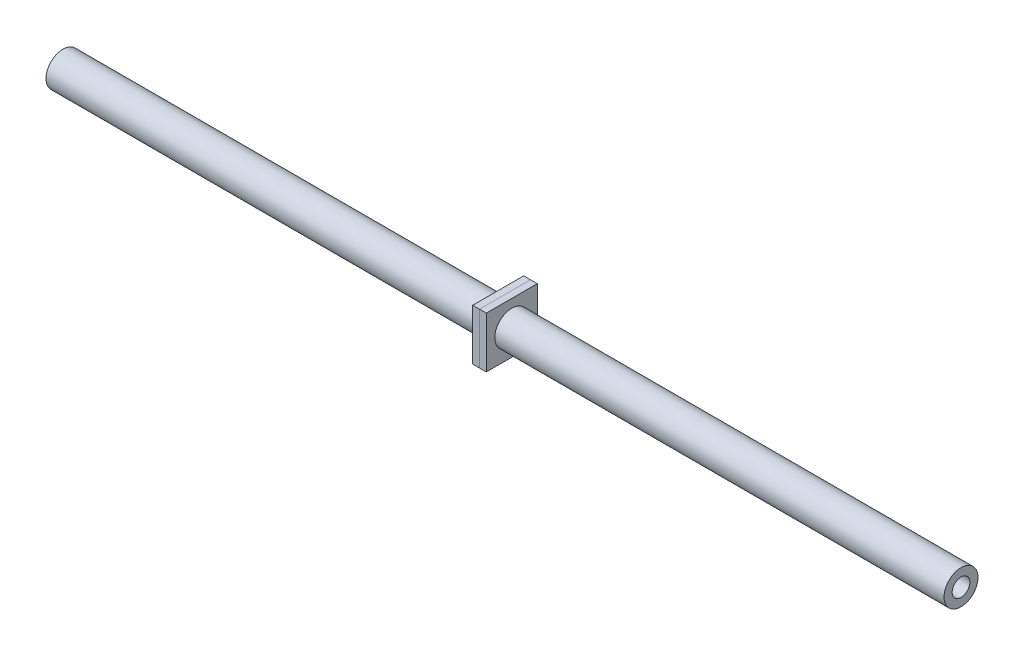
ISO-10303-21;
HEADER;
FILE_DESCRIPTION(('STEP AP214'),'2;1');
FILE_NAME('part.step','',(''),(''),'','','');
FILE_SCHEMA(('AUTOMOTIVE_DESIGN { 1 0 10303 214 1 1 1 1 }'));
ENDSEC;
DATA;
#1=APPLICATION_CONTEXT('core data for automotive mechanical design processes');
#2=APPLICATION_PROTOCOL_DEFINITION('international standard','automotive_design',2000,#1);
#3=PRODUCT_CONTEXT('',#1,'mechanical');
#4=PRODUCT('Part','Part','',(#3));
#5=PRODUCT_RELATED_PRODUCT_CATEGORY('part','',(#4));
#6=PRODUCT_DEFINITION_FORMATION('','',#4);
#7=PRODUCT_DEFINITION_CONTEXT('part definition',#1,'design');
#8=PRODUCT_DEFINITION('design','',#6,#7);
#9=PRODUCT_DEFINITION_SHAPE('','',#8);
#10=(LENGTH_UNIT() NAMED_UNIT(*) SI_UNIT(.MILLI.,.METRE.));
#11=(NAMED_UNIT(*) PLANE_ANGLE_UNIT() SI_UNIT($,.RADIAN.));
#12=(NAMED_UNIT(*) SI_UNIT($,.STERADIAN.) SOLID_ANGLE_UNIT());
#13=UNCERTAINTY_MEASURE_WITH_UNIT(LENGTH_MEASURE(1.E-05),#10,'distance_accuracy_value','');
#14=(GEOMETRIC_REPRESENTATION_CONTEXT(3) GLOBAL_UNCERTAINTY_ASSIGNED_CONTEXT((#13)) GLOBAL_UNIT_ASSIGNED_CONTEXT((#10,
#11,#12)) REPRESENTATION_CONTEXT('',''));
#15=CARTESIAN_POINT('',(0.,0.,0.));
#16=DIRECTION('',(0.,0.,1.));
#17=DIRECTION('',(1.,0.,0.));
#18=AXIS2_PLACEMENT_3D('',#15,#16,#17);
#19=CARTESIAN_POINT('',(162.56,0.,0.));
#20=DIRECTION('',(1.,0.,0.));
#21=DIRECTION('',(0.,0.,-1.));
#22=AXIS2_PLACEMENT_3D('',#19,#20,#21);
#23=PLANE('',#22);
#24=DIRECTION('',(0.,1.,0.));
#25=VECTOR('',#24,1.);
#26=CARTESIAN_POINT('',(162.56,0.,-9.525));
#27=LINE('',#26,#25);
#28=CARTESIAN_POINT('',(162.56,-9.525,-9.525));
#29=VERTEX_POINT('',#28);
#30=CARTESIAN_POINT('',(162.56,9.525,-9.525));
#31=VERTEX_POINT('',#30);
#32=EDGE_CURVE('E113',#29,#31,#27,.T.);
#33=ORIENTED_EDGE('',*,*,#32,.F.);
#34=DIRECTION('',(0.,0.,-1.));
#35=VECTOR('',#34,1.);
#36=CARTESIAN_POINT('',(162.56,-9.525,0.));
#37=LINE('',#36,#35);
#38=CARTESIAN_POINT('',(162.56,-9.52500000000001,9.525));
#39=VERTEX_POINT('',#38);
#40=EDGE_CURVE('E110',#39,#29,#37,.T.);
#41=ORIENTED_EDGE('',*,*,#40,.F.);
#42=DIRECTION('',(0.,-1.,0.));
#43=VECTOR('',#42,1.);
#44=CARTESIAN_POINT('',(162.56,0.,9.525));
#45=LINE('',#44,#43);
#46=CARTESIAN_POINT('',(162.56,9.525,9.52500000000001));
#47=VERTEX_POINT('',#46);
#48=EDGE_CURVE('E103',#47,#39,#45,.T.);
#49=ORIENTED_EDGE('',*,*,#48,.F.);
#50=DIRECTION('',(0.,0.,1.));
#51=VECTOR('',#50,1.);
#52=CARTESIAN_POINT('',(162.56,9.525,0.));
#53=LINE('',#52,#51);
#54=EDGE_CURVE('E109',#31,#47,#53,.T.);
#55=ORIENTED_EDGE('',*,*,#54,.F.);
#56=EDGE_LOOP('',(#33,#41,#49,#55));
#57=FACE_BOUND('',#56,.T.);
#58=CARTESIAN_POINT('',(162.56,0.,0.));
#59=DIRECTION('',(-1.,0.,0.));
#60=DIRECTION('',(0.,0.,1.));
#61=AXIS2_PLACEMENT_3D('',#58,#59,#60);
#62=CIRCLE('',#61,6.35);
#63=CARTESIAN_POINT('',(162.56,0.,6.35));
#64=VERTEX_POINT('',#63);
#65=EDGE_CURVE('E124',#64,#64,#62,.T.);
#66=ORIENTED_EDGE('',*,*,#65,.F.);
#67=EDGE_LOOP('',(#66));
#68=FACE_BOUND('',#67,.T.);
#69=ADVANCED_FACE('F54',(#57,#68),#23,.F.);
#70=CARTESIAN_POINT('',(165.1,0.,0.));
#71=DIRECTION('',(1.,0.,0.));
#72=DIRECTION('',(0.,0.,-1.));
#73=AXIS2_PLACEMENT_3D('',#70,#71,#72);
#74=PLANE('',#73);
#75=DIRECTION('',(0.,1.,0.));
#76=VECTOR('',#75,1.);
#77=CARTESIAN_POINT('',(165.1,0.,-9.525));
#78=LINE('',#77,#76);
#79=CARTESIAN_POINT('',(165.1,-9.525,-9.525));
#80=VERTEX_POINT('',#79);
#81=CARTESIAN_POINT('',(165.1,9.525,-9.525));
#82=VERTEX_POINT('',#81);
#83=EDGE_CURVE('E120',#80,#82,#78,.T.);
#84=ORIENTED_EDGE('',*,*,#83,.T.);
#85=DIRECTION('',(0.,0.,1.));
#86=VECTOR('',#85,1.);
#87=CARTESIAN_POINT('',(165.1,9.525,0.));
#88=LINE('',#87,#86);
#89=CARTESIAN_POINT('',(165.1,9.525,9.52500000000001));
#90=VERTEX_POINT('',#89);
#91=EDGE_CURVE('E123',#82,#90,#88,.T.);
#92=ORIENTED_EDGE('',*,*,#91,.T.);
#93=DIRECTION('',(0.,-1.,0.));
#94=VECTOR('',#93,1.);
#95=CARTESIAN_POINT('',(165.1,0.,9.525));
#96=LINE('',#95,#94);
#97=CARTESIAN_POINT('',(165.1,-9.52500000000001,9.525));
#98=VERTEX_POINT('',#97);
#99=EDGE_CURVE('E105',#90,#98,#96,.T.);
#100=ORIENTED_EDGE('',*,*,#99,.T.);
#101=DIRECTION('',(0.,0.,-1.));
#102=VECTOR('',#101,1.);
#103=CARTESIAN_POINT('',(165.1,-9.525,0.));
#104=LINE('',#103,#102);
#105=EDGE_CURVE('E115',#98,#80,#104,.T.);
#106=ORIENTED_EDGE('',*,*,#105,.T.);
#107=EDGE_LOOP('',(#84,#92,#100,#106));
#108=FACE_BOUND('',#107,.T.);
#109=CARTESIAN_POINT('',(165.1,0.,0.));
#110=DIRECTION('',(-1.,0.,0.));
#111=DIRECTION('',(0.,0.,1.));
#112=AXIS2_PLACEMENT_3D('',#109,#110,#111);
#113=CIRCLE('',#112,6.35);
#114=CARTESIAN_POINT('',(165.1,0.,6.35));
#115=VERTEX_POINT('',#114);
#116=EDGE_CURVE('E158',#115,#115,#113,.T.);
#117=ORIENTED_EDGE('',*,*,#116,.T.);
#118=EDGE_LOOP('',(#117));
#119=FACE_BOUND('',#118,.T.);
#120=ADVANCED_FACE('F130',(#108,#119),#74,.T.);
#121=CARTESIAN_POINT('',(162.56,0.,-9.525));
#122=DIRECTION('',(0.,0.,-1.));
#123=DIRECTION('',(0.,1.,0.));
#124=AXIS2_PLACEMENT_3D('',#121,#122,#123);
#125=PLANE('',#124);
#126=ORIENTED_EDGE('',*,*,#83,.F.);
#127=DIRECTION('',(1.,0.,0.));
#128=VECTOR('',#127,1.);
#129=CARTESIAN_POINT('',(162.56,-9.525,-9.525));
#130=LINE('',#129,#128);
#131=EDGE_CURVE('E13',#29,#80,#130,.T.);
#132=ORIENTED_EDGE('',*,*,#131,.F.);
#133=ORIENTED_EDGE('',*,*,#32,.T.);
#134=DIRECTION('',(1.,0.,0.));
#135=VECTOR('',#134,1.);
#136=CARTESIAN_POINT('',(162.56,9.525,-9.525));
#137=LINE('',#136,#135);
#138=EDGE_CURVE('E58',#31,#82,#137,.T.);
#139=ORIENTED_EDGE('',*,*,#138,.T.);
#140=EDGE_LOOP('',(#126,#132,#133,#139));
#141=FACE_BOUND('',#140,.T.);
#142=ADVANCED_FACE('F56',(#141),#125,.T.);
#143=CARTESIAN_POINT('',(162.56,-9.525,0.));
#144=DIRECTION('',(0.,-1.,0.));
#145=DIRECTION('',(0.,0.,-1.));
#146=AXIS2_PLACEMENT_3D('',#143,#144,#145);
#147=PLANE('',#146);
#148=ORIENTED_EDGE('',*,*,#105,.F.);
#149=DIRECTION('',(1.,0.,0.));
#150=VECTOR('',#149,1.);
#151=CARTESIAN_POINT('',(162.56,-9.52500000000001,9.525));
#152=LINE('',#151,#150);
#153=EDGE_CURVE('E64',#39,#98,#152,.T.);
#154=ORIENTED_EDGE('',*,*,#153,.F.);
#155=ORIENTED_EDGE('',*,*,#40,.T.);
#156=ORIENTED_EDGE('',*,*,#131,.T.);
#157=EDGE_LOOP('',(#148,#154,#155,#156));
#158=FACE_BOUND('',#157,.T.);
#159=ADVANCED_FACE('F132',(#158),#147,.T.);
#160=CARTESIAN_POINT('',(162.56,0.,9.525));
#161=DIRECTION('',(0.,0.,1.));
#162=DIRECTION('',(0.,-1.,0.));
#163=AXIS2_PLACEMENT_3D('',#160,#161,#162);
#164=PLANE('',#163);
#165=ORIENTED_EDGE('',*,*,#99,.F.);
#166=DIRECTION('',(1.,0.,0.));
#167=VECTOR('',#166,1.);
#168=CARTESIAN_POINT('',(162.56,9.525,9.52500000000001));
#169=LINE('',#168,#167);
#170=EDGE_CURVE('E100',#47,#90,#169,.T.);
#171=ORIENTED_EDGE('',*,*,#170,.F.);
#172=ORIENTED_EDGE('',*,*,#48,.T.);
#173=ORIENTED_EDGE('',*,*,#153,.T.);
#174=EDGE_LOOP('',(#165,#171,#172,#173));
#175=FACE_BOUND('',#174,.T.);
#176=ADVANCED_FACE('F102',(#175),#164,.T.);
#177=CARTESIAN_POINT('',(162.56,9.525,0.));
#178=DIRECTION('',(0.,1.,0.));
#179=DIRECTION('',(0.,0.,1.));
#180=AXIS2_PLACEMENT_3D('',#177,#178,#179);
#181=PLANE('',#180);
#182=ORIENTED_EDGE('',*,*,#91,.F.);
#183=ORIENTED_EDGE('',*,*,#138,.F.);
#184=ORIENTED_EDGE('',*,*,#54,.T.);
#185=ORIENTED_EDGE('',*,*,#170,.T.);
#186=EDGE_LOOP('',(#182,#183,#184,#185));
#187=FACE_BOUND('',#186,.T.);
#188=ADVANCED_FACE('F112',(#187),#181,.T.);
#189=CARTESIAN_POINT('',(162.56,0.,0.));
#190=DIRECTION('',(1.,0.,0.));
#191=DIRECTION('',(0.,0.,-1.));
#192=AXIS2_PLACEMENT_3D('',#189,#190,#191);
#193=CYLINDRICAL_SURFACE('',#192,6.35);
#194=ORIENTED_EDGE('',*,*,#65,.T.);
#195=EDGE_LOOP('',(#194));
#196=FACE_BOUND('',#195,.T.);
#197=ORIENTED_EDGE('',*,*,#116,.F.);
#198=EDGE_LOOP('',(#197));
#199=FACE_BOUND('',#198,.T.);
#200=ADVANCED_FACE('F147',(#196,#199),#193,.F.);
#201=CLOSED_SHELL('',(#69,#120,#142,#159,#176,#188,#200));
#202=MANIFOLD_SOLID_BREP('B2',#201);
#203=CARTESIAN_POINT('',(167.64,0.,0.));
#204=DIRECTION('',(-1.,0.,0.));
#205=DIRECTION('',(0.,0.,1.));
#206=AXIS2_PLACEMENT_3D('',#203,#204,#205);
#207=PLANE('',#206);
#208=DIRECTION('',(0.,-1.,0.));
#209=VECTOR('',#208,1.);
#210=CARTESIAN_POINT('',(167.64,9.525,9.52500000000001));
#211=LINE('',#210,#209);
#212=CARTESIAN_POINT('',(167.64,9.525,9.52500000000001));
#213=VERTEX_POINT('',#212);
#214=CARTESIAN_POINT('',(167.64,-9.52500000000001,9.525));
#215=VERTEX_POINT('',#214);
#216=EDGE_CURVE('E257',#213,#215,#211,.T.);
#217=ORIENTED_EDGE('',*,*,#216,.T.);
#218=DIRECTION('',(0.,0.,-1.));
#219=VECTOR('',#218,1.);
#220=CARTESIAN_POINT('',(167.64,-9.525,-9.525));
#221=LINE('',#220,#219);
#222=CARTESIAN_POINT('',(167.64,-9.525,-9.525));
#223=VERTEX_POINT('',#222);
#224=EDGE_CURVE('E252',#215,#223,#221,.T.);
#225=ORIENTED_EDGE('',*,*,#224,.T.);
#226=DIRECTION('',(0.,1.,0.));
#227=VECTOR('',#226,1.);
#228=CARTESIAN_POINT('',(167.64,9.525,-9.525));
#229=LINE('',#228,#227);
#230=CARTESIAN_POINT('',(167.64,9.525,-9.525));
#231=VERTEX_POINT('',#230);
#232=EDGE_CURVE('E255',#223,#231,#229,.T.);
#233=ORIENTED_EDGE('',*,*,#232,.T.);
#234=DIRECTION('',(0.,0.,1.));
#235=VECTOR('',#234,1.);
#236=CARTESIAN_POINT('',(167.64,9.525,-9.525));
#237=LINE('',#236,#235);
#238=EDGE_CURVE('E222',#231,#213,#237,.T.);
#239=ORIENTED_EDGE('',*,*,#238,.T.);
#240=EDGE_LOOP('',(#217,#225,#233,#239));
#241=FACE_BOUND('',#240,.T.);
#242=CARTESIAN_POINT('',(167.64,0.,0.));
#243=DIRECTION('',(1.,0.,0.));
#244=DIRECTION('',(0.,0.,-1.));
#245=AXIS2_PLACEMENT_3D('',#242,#243,#244);
#246=CIRCLE('',#245,6.35);
#247=CARTESIAN_POINT('',(167.64,0.,-6.35));
#248=VERTEX_POINT('',#247);
#249=EDGE_CURVE('E272',#248,#248,#246,.T.);
#250=ORIENTED_EDGE('',*,*,#249,.F.);
#251=EDGE_LOOP('',(#250));
#252=FACE_BOUND('',#251,.T.);
#253=ADVANCED_FACE('F205',(#241,#252),#207,.F.);
#254=CARTESIAN_POINT('',(165.1,0.,0.));
#255=DIRECTION('',(-1.,0.,0.));
#256=DIRECTION('',(0.,0.,1.));
#257=AXIS2_PLACEMENT_3D('',#254,#255,#256);
#258=PLANE('',#257);
#259=DIRECTION('',(0.,-1.,0.));
#260=VECTOR('',#259,1.);
#261=CARTESIAN_POINT('',(165.1,9.525,9.52500000000001));
#262=LINE('',#261,#260);
#263=CARTESIAN_POINT('',(165.1,9.525,9.52500000000001));
#264=VERTEX_POINT('',#263);
#265=CARTESIAN_POINT('',(165.1,-9.52500000000001,9.525));
#266=VERTEX_POINT('',#265);
#267=EDGE_CURVE('E269',#264,#266,#262,.T.);
#268=ORIENTED_EDGE('',*,*,#267,.F.);
#269=DIRECTION('',(0.,0.,1.));
#270=VECTOR('',#269,1.);
#271=CARTESIAN_POINT('',(165.1,9.525,-9.525));
#272=LINE('',#271,#270);
#273=CARTESIAN_POINT('',(165.1,9.525,-9.525));
#274=VERTEX_POINT('',#273);
#275=EDGE_CURVE('E245',#274,#264,#272,.T.);
#276=ORIENTED_EDGE('',*,*,#275,.F.);
#277=DIRECTION('',(0.,1.,0.));
#278=VECTOR('',#277,1.);
#279=CARTESIAN_POINT('',(165.1,9.525,-9.525));
#280=LINE('',#279,#278);
#281=CARTESIAN_POINT('',(165.1,-9.525,-9.525));
#282=VERTEX_POINT('',#281);
#283=EDGE_CURVE('E239',#282,#274,#280,.T.);
#284=ORIENTED_EDGE('',*,*,#283,.F.);
#285=DIRECTION('',(0.,0.,-1.));
#286=VECTOR('',#285,1.);
#287=CARTESIAN_POINT('',(165.1,-9.525,-9.525));
#288=LINE('',#287,#286);
#289=EDGE_CURVE('E261',#266,#282,#288,.T.);
#290=ORIENTED_EDGE('',*,*,#289,.F.);
#291=EDGE_LOOP('',(#268,#276,#284,#290));
#292=FACE_BOUND('',#291,.T.);
#293=CARTESIAN_POINT('',(165.1,0.,0.));
#294=DIRECTION('',(1.,0.,0.));
#295=DIRECTION('',(0.,0.,-1.));
#296=AXIS2_PLACEMENT_3D('',#293,#294,#295);
#297=CIRCLE('',#296,6.35);
#298=CARTESIAN_POINT('',(165.1,0.,-6.35));
#299=VERTEX_POINT('',#298);
#300=EDGE_CURVE('E284',#299,#299,#297,.T.);
#301=ORIENTED_EDGE('',*,*,#300,.T.);
#302=EDGE_LOOP('',(#301));
#303=FACE_BOUND('',#302,.T.);
#304=ADVANCED_FACE('F280',(#292,#303),#258,.T.);
#305=CARTESIAN_POINT('',(167.64,9.525,9.52500000000001));
#306=DIRECTION('',(0.,0.,-1.));
#307=DIRECTION('',(0.,1.,0.));
#308=AXIS2_PLACEMENT_3D('',#305,#306,#307);
#309=PLANE('',#308);
#310=ORIENTED_EDGE('',*,*,#267,.T.);
#311=DIRECTION('',(-1.,0.,0.));
#312=VECTOR('',#311,1.);
#313=CARTESIAN_POINT('',(167.64,-9.52500000000001,9.525));
#314=LINE('',#313,#312);
#315=EDGE_CURVE('E52',#215,#266,#314,.T.);
#316=ORIENTED_EDGE('',*,*,#315,.F.);
#317=ORIENTED_EDGE('',*,*,#216,.F.);
#318=DIRECTION('',(-1.,0.,0.));
#319=VECTOR('',#318,1.);
#320=CARTESIAN_POINT('',(167.64,9.525,9.52500000000001));
#321=LINE('',#320,#319);
#322=EDGE_CURVE('E265',#213,#264,#321,.T.);
#323=ORIENTED_EDGE('',*,*,#322,.T.);
#324=EDGE_LOOP('',(#310,#316,#317,#323));
#325=FACE_BOUND('',#324,.T.);
#326=ADVANCED_FACE('F207',(#325),#309,.F.);
#327=CARTESIAN_POINT('',(167.64,-9.525,-9.525));
#328=DIRECTION('',(0.,1.,0.));
#329=DIRECTION('',(0.,0.,1.));
#330=AXIS2_PLACEMENT_3D('',#327,#328,#329);
#331=PLANE('',#330);
#332=ORIENTED_EDGE('',*,*,#289,.T.);
#333=DIRECTION('',(-1.,0.,0.));
#334=VECTOR('',#333,1.);
#335=CARTESIAN_POINT('',(167.64,-9.525,-9.525));
#336=LINE('',#335,#334);
#337=EDGE_CURVE('E214',#223,#282,#336,.T.);
#338=ORIENTED_EDGE('',*,*,#337,.F.);
#339=ORIENTED_EDGE('',*,*,#224,.F.);
#340=ORIENTED_EDGE('',*,*,#315,.T.);
#341=EDGE_LOOP('',(#332,#338,#339,#340));
#342=FACE_BOUND('',#341,.T.);
#343=ADVANCED_FACE('F260',(#342),#331,.F.);
#344=CARTESIAN_POINT('',(167.64,9.525,-9.525));
#345=DIRECTION('',(0.,0.,1.));
#346=DIRECTION('',(0.,-1.,0.));
#347=AXIS2_PLACEMENT_3D('',#344,#345,#346);
#348=PLANE('',#347);
#349=ORIENTED_EDGE('',*,*,#283,.T.);
#350=DIRECTION('',(-1.,0.,0.));
#351=VECTOR('',#350,1.);
#352=CARTESIAN_POINT('',(167.64,9.525,-9.525));
#353=LINE('',#352,#351);
#354=EDGE_CURVE('E262',#231,#274,#353,.T.);
#355=ORIENTED_EDGE('',*,*,#354,.F.);
#356=ORIENTED_EDGE('',*,*,#232,.F.);
#357=ORIENTED_EDGE('',*,*,#337,.T.);
#358=EDGE_LOOP('',(#349,#355,#356,#357));
#359=FACE_BOUND('',#358,.T.);
#360=ADVANCED_FACE('F263',(#359),#348,.F.);
#361=CARTESIAN_POINT('',(167.64,9.525,-9.525));
#362=DIRECTION('',(0.,-1.,0.));
#363=DIRECTION('',(0.,0.,-1.));
#364=AXIS2_PLACEMENT_3D('',#361,#362,#363);
#365=PLANE('',#364);
#366=ORIENTED_EDGE('',*,*,#275,.T.);
#367=ORIENTED_EDGE('',*,*,#322,.F.);
#368=ORIENTED_EDGE('',*,*,#238,.F.);
#369=ORIENTED_EDGE('',*,*,#354,.T.);
#370=EDGE_LOOP('',(#366,#367,#368,#369));
#371=FACE_BOUND('',#370,.T.);
#372=ADVANCED_FACE('F277',(#371),#365,.F.);
#373=CARTESIAN_POINT('',(167.64,0.,0.));
#374=DIRECTION('',(-1.,0.,0.));
#375=DIRECTION('',(0.,0.,1.));
#376=AXIS2_PLACEMENT_3D('',#373,#374,#375);
#377=CYLINDRICAL_SURFACE('',#376,6.35);
#378=ORIENTED_EDGE('',*,*,#249,.T.);
#379=EDGE_LOOP('',(#378));
#380=FACE_BOUND('',#379,.T.);
#381=ORIENTED_EDGE('',*,*,#300,.F.);
#382=EDGE_LOOP('',(#381));
#383=FACE_BOUND('',#382,.T.);
#384=ADVANCED_FACE('F290',(#380,#383),#377,.F.);
#385=CLOSED_SHELL('',(#253,#304,#326,#343,#360,#372,#384));
#386=MANIFOLD_SOLID_BREP('B7',#385);
#387=CARTESIAN_POINT('',(335.464234074,0.,0.));
#388=DIRECTION('',(-1.,0.,0.));
#389=DIRECTION('',(0.,0.,1.));
#390=AXIS2_PLACEMENT_3D('',#387,#388,#389);
#391=CYLINDRICAL_SURFACE('',#390,3.302);
#392=CARTESIAN_POINT('',(335.464234074,0.,0.));
#393=DIRECTION('',(1.,0.,0.));
#394=DIRECTION('',(0.,0.,-1.));
#395=AXIS2_PLACEMENT_3D('',#392,#393,#394);
#396=CIRCLE('',#395,3.302);
#397=CARTESIAN_POINT('',(335.464234074,0.,3.302));
#398=VERTEX_POINT('',#397);
#399=EDGE_CURVE('E356',#398,#398,#396,.T.);
#400=CARTESIAN_POINT('',(0.,0.,0.));
#401=DIRECTION('',(1.,0.,0.));
#402=DIRECTION('',(0.,0.,-1.));
#403=AXIS2_PLACEMENT_3D('',#400,#401,#402);
#404=CIRCLE('',#403,3.302);
#405=CARTESIAN_POINT('',(0.,0.,3.302));
#406=VERTEX_POINT('',#405);
#407=EDGE_CURVE('E362',#406,#406,#404,.T.);
#408=CARTESIAN_POINT('',(335.464234074,0.,3.302));
#409=CARTESIAN_POINT('',(331.969814969062,0.,3.302));
#410=CARTESIAN_POINT('',(328.475395864125,0.,3.302));
#411=CARTESIAN_POINT('',(321.48655765425,0.,3.302));
#412=CARTESIAN_POINT('',(317.992138549312,0.,3.302));
#413=CARTESIAN_POINT('',(311.003300339437,0.,3.302));
#414=CARTESIAN_POINT('',(307.5088812345,0.,3.302));
#415=CARTESIAN_POINT('',(300.520043024625,0.,3.302));
#416=CARTESIAN_POINT('',(297.025623919687,0.,3.302));
#417=CARTESIAN_POINT('',(290.036785709812,0.,3.302));
#418=CARTESIAN_POINT('',(286.542366604875,0.,3.302));
#419=CARTESIAN_POINT('',(279.553528395,0.,3.302));
#420=CARTESIAN_POINT('',(276.059109290062,0.,3.302));
#421=CARTESIAN_POINT('',(269.070271080187,0.,3.302));
#422=CARTESIAN_POINT('',(265.57585197525,0.,3.302));
#423=CARTESIAN_POINT('',(258.587013765375,0.,3.302));
#424=CARTESIAN_POINT('',(255.092594660437,0.,3.302));
#425=CARTESIAN_POINT('',(248.103756450562,0.,3.302));
#426=CARTESIAN_POINT('',(244.609337345625,0.,3.302));
#427=CARTESIAN_POINT('',(237.62049913575,0.,3.302));
#428=CARTESIAN_POINT('',(234.126080030812,0.,3.302));
#429=CARTESIAN_POINT('',(227.137241820937,0.,3.302));
#430=CARTESIAN_POINT('',(223.642822716,0.,3.302));
#431=CARTESIAN_POINT('',(216.653984506125,0.,3.302));
#432=CARTESIAN_POINT('',(213.159565401188,0.,3.302));
#433=CARTESIAN_POINT('',(206.170727191312,0.,3.302));
#434=CARTESIAN_POINT('',(202.676308086375,0.,3.302));
#435=CARTESIAN_POINT('',(195.6874698765,0.,3.302));
#436=CARTESIAN_POINT('',(192.193050771562,0.,3.302));
#437=CARTESIAN_POINT('',(185.204212561687,0.,3.302));
#438=CARTESIAN_POINT('',(181.70979345675,0.,3.302));
#439=CARTESIAN_POINT('',(174.720955246875,0.,3.302));
#440=CARTESIAN_POINT('',(171.226536141937,0.,3.302));
#441=CARTESIAN_POINT('',(164.237697932062,0.,3.302));
#442=CARTESIAN_POINT('',(160.743278827125,0.,3.302));
#443=CARTESIAN_POINT('',(153.75444061725,0.,3.302));
#444=CARTESIAN_POINT('',(150.260021512312,0.,3.302));
#445=CARTESIAN_POINT('',(143.271183302437,0.,3.302));
#446=CARTESIAN_POINT('',(139.7767641975,0.,3.302));
#447=CARTESIAN_POINT('',(132.787925987625,0.,3.302));
#448=CARTESIAN_POINT('',(129.293506882687,0.,3.302));
#449=CARTESIAN_POINT('',(122.304668672812,0.,3.302));
#450=CARTESIAN_POINT('',(118.810249567875,0.,3.302));
#451=CARTESIAN_POINT('',(111.821411358,0.,3.302));
#452=CARTESIAN_POINT('',(108.326992253062,0.,3.302));
#453=CARTESIAN_POINT('',(101.338154043187,0.,3.302));
#454=CARTESIAN_POINT('',(97.84373493825,0.,3.302));
#455=CARTESIAN_POINT('',(90.854896728375,0.,3.302));
#456=CARTESIAN_POINT('',(87.3604776234375,0.,3.302));
#457=CARTESIAN_POINT('',(80.3716394135625,0.,3.302));
#458=CARTESIAN_POINT('',(76.877220308625,0.,3.302));
#459=CARTESIAN_POINT('',(69.88838209875,0.,3.302));
#460=CARTESIAN_POINT('',(66.3939629938125,0.,3.302));
#461=CARTESIAN_POINT('',(59.4051247839375,0.,3.302));
#462=CARTESIAN_POINT('',(55.910705679,0.,3.302));
#463=CARTESIAN_POINT('',(48.921867469125,0.,3.302));
#464=CARTESIAN_POINT('',(45.4274483641875,0.,3.302));
#465=CARTESIAN_POINT('',(38.4386101543125,0.,3.302));
#466=CARTESIAN_POINT('',(34.944191049375,0.,3.302));
#467=CARTESIAN_POINT('',(27.9553528395,0.,3.302));
#468=CARTESIAN_POINT('',(24.4609337345625,0.,3.302));
#469=CARTESIAN_POINT('',(17.4720955246875,0.,3.302));
#470=CARTESIAN_POINT('',(13.97767641975,0.,3.302));
#471=CARTESIAN_POINT('',(6.98883820987499,0.,3.302));
#472=CARTESIAN_POINT('',(3.49441910493749,0.,3.302));
#473=CARTESIAN_POINT('',(0.,0.,3.302));
#474=B_SPLINE_CURVE_WITH_KNOTS('',3,(#408,#409,#410,#411,#412,#413,#414,#415,#416,#417,#418,
#419,#420,#421,#422,#423,#424,#425,#426,#427,#428,#429,#430,#431,#432,#433,#434,#435,#436,#437,
#438,#439,#440,#441,#442,#443,#444,#445,#446,#447,#448,#449,#450,#451,#452,#453,#454,#455,#456,
#457,#458,#459,#460,#461,#462,#463,#464,#465,#466,#467,#468,#469,#470,#471,#472,#473),
.UNSPECIFIED.,.F.,.F.,(4,2,2,2,2,2,2,2,2,2,2,2,2,2,2,2,2,2,2,2,2,2,2,2,2,2,2,2,2,2,2,2,4),(0.,
10.4832573148125,20.966514629625,31.4497719444375,41.93302925925,52.4162865740626,
62.899543888875,73.3828012036875,83.8660585185,94.3493158333125,104.832573148125,
115.315830462938,125.79908777775,136.282345092563,146.765602407375,157.248859722188,
167.732117037,178.215374351813,188.698631666625,199.181888981438,209.66514629625,
220.148403611063,230.631660925875,241.114918240688,251.5981755555,262.081432870312,
272.564690185125,283.047947499937,293.53120481475,304.014462129563,314.497719444375,
324.980976759188,335.464234074),.UNSPECIFIED.);
#475=EDGE_CURVE('BSEAM349',#398,#406,#474,.T.);
#476=ORIENTED_EDGE('',*,*,#399,.T.);
#477=ORIENTED_EDGE('',*,*,#407,.F.);
#478=ORIENTED_EDGE('',*,*,#475,.T.);
#479=ORIENTED_EDGE('',*,*,#475,.F.);
#480=EDGE_LOOP('',(#476,#478,#477,#479));
#481=FACE_BOUND('',#480,.T.);
#482=ADVANCED_FACE('F349',(#481),#391,.F.);
#483=CARTESIAN_POINT('',(335.464234074,0.,0.));
#484=DIRECTION('',(-1.,0.,0.));
#485=DIRECTION('',(0.,0.,1.));
#486=AXIS2_PLACEMENT_3D('',#483,#484,#485);
#487=CYLINDRICAL_SURFACE('',#486,6.35);
#488=CARTESIAN_POINT('',(335.464234074,0.,0.));
#489=DIRECTION('',(1.,0.,0.));
#490=DIRECTION('',(0.,0.,-1.));
#491=AXIS2_PLACEMENT_3D('',#488,#489,#490);
#492=CIRCLE('',#491,6.35);
#493=CARTESIAN_POINT('',(335.464234074,0.,6.35));
#494=VERTEX_POINT('',#493);
#495=EDGE_CURVE('E204',#494,#494,#492,.T.);
#496=CARTESIAN_POINT('',(0.,0.,0.));
#497=DIRECTION('',(1.,0.,0.));
#498=DIRECTION('',(0.,0.,-1.));
#499=AXIS2_PLACEMENT_3D('',#496,#497,#498);
#500=CIRCLE('',#499,6.35);
#501=CARTESIAN_POINT('',(0.,0.,6.35));
#502=VERTEX_POINT('',#501);
#503=EDGE_CURVE('E352',#502,#502,#500,.T.);
#504=CARTESIAN_POINT('',(335.464234074,0.,6.35));
#505=CARTESIAN_POINT('',(331.969814969062,0.,6.35));
#506=CARTESIAN_POINT('',(328.475395864125,0.,6.35));
#507=CARTESIAN_POINT('',(321.48655765425,0.,6.35));
#508=CARTESIAN_POINT('',(317.992138549312,0.,6.35));
#509=CARTESIAN_POINT('',(311.003300339437,0.,6.35));
#510=CARTESIAN_POINT('',(307.5088812345,0.,6.35));
#511=CARTESIAN_POINT('',(300.520043024625,0.,6.35));
#512=CARTESIAN_POINT('',(297.025623919687,0.,6.35));
#513=CARTESIAN_POINT('',(290.036785709813,0.,6.35));
#514=CARTESIAN_POINT('',(286.542366604875,0.,6.35));
#515=CARTESIAN_POINT('',(279.553528395,0.,6.35));
#516=CARTESIAN_POINT('',(276.059109290063,0.,6.35));
#517=CARTESIAN_POINT('',(269.070271080187,0.,6.35));
#518=CARTESIAN_POINT('',(265.57585197525,0.,6.35));
#519=CARTESIAN_POINT('',(258.587013765375,0.,6.35));
#520=CARTESIAN_POINT('',(255.092594660437,0.,6.35));
#521=CARTESIAN_POINT('',(248.103756450563,0.,6.35));
#522=CARTESIAN_POINT('',(244.609337345625,0.,6.35));
#523=CARTESIAN_POINT('',(237.62049913575,0.,6.35));
#524=CARTESIAN_POINT('',(234.126080030813,0.,6.35));
#525=CARTESIAN_POINT('',(227.137241820938,0.,6.35));
#526=CARTESIAN_POINT('',(223.642822716,0.,6.35));
#527=CARTESIAN_POINT('',(216.653984506125,0.,6.35));
#528=CARTESIAN_POINT('',(213.159565401188,0.,6.35));
#529=CARTESIAN_POINT('',(206.170727191312,0.,6.35));
#530=CARTESIAN_POINT('',(202.676308086375,0.,6.35));
#531=CARTESIAN_POINT('',(195.6874698765,0.,6.35));
#532=CARTESIAN_POINT('',(192.193050771563,0.,6.35));
#533=CARTESIAN_POINT('',(185.204212561688,0.,6.35));
#534=CARTESIAN_POINT('',(181.70979345675,0.,6.35));
#535=CARTESIAN_POINT('',(174.720955246875,0.,6.35));
#536=CARTESIAN_POINT('',(171.226536141938,0.,6.35));
#537=CARTESIAN_POINT('',(164.237697932063,0.,6.35));
#538=CARTESIAN_POINT('',(160.743278827125,0.,6.35));
#539=CARTESIAN_POINT('',(153.75444061725,0.,6.35));
#540=CARTESIAN_POINT('',(150.260021512313,0.,6.35));
#541=CARTESIAN_POINT('',(143.271183302437,0.,6.35));
#542=CARTESIAN_POINT('',(139.7767641975,0.,6.35));
#543=CARTESIAN_POINT('',(132.787925987625,0.,6.35));
#544=CARTESIAN_POINT('',(129.293506882687,0.,6.35));
#545=CARTESIAN_POINT('',(122.304668672813,0.,6.35));
#546=CARTESIAN_POINT('',(118.810249567875,0.,6.35));
#547=CARTESIAN_POINT('',(111.821411358,0.,6.35));
#548=CARTESIAN_POINT('',(108.326992253062,0.,6.35));
#549=CARTESIAN_POINT('',(101.338154043188,0.,6.35));
#550=CARTESIAN_POINT('',(97.84373493825,0.,6.35));
#551=CARTESIAN_POINT('',(90.854896728375,0.,6.35));
#552=CARTESIAN_POINT('',(87.3604776234375,0.,6.35));
#553=CARTESIAN_POINT('',(80.3716394135625,0.,6.35));
#554=CARTESIAN_POINT('',(76.877220308625,0.,6.35));
#555=CARTESIAN_POINT('',(69.88838209875,0.,6.35));
#556=CARTESIAN_POINT('',(66.3939629938125,0.,6.35));
#557=CARTESIAN_POINT('',(59.4051247839375,0.,6.35));
#558=CARTESIAN_POINT('',(55.910705679,0.,6.35));
#559=CARTESIAN_POINT('',(48.921867469125,0.,6.35));
#560=CARTESIAN_POINT('',(45.4274483641875,0.,6.35));
#561=CARTESIAN_POINT('',(38.4386101543125,0.,6.35));
#562=CARTESIAN_POINT('',(34.944191049375,0.,6.35));
#563=CARTESIAN_POINT('',(27.9553528395,0.,6.35));
#564=CARTESIAN_POINT('',(24.4609337345625,0.,6.35));
#565=CARTESIAN_POINT('',(17.4720955246875,0.,6.35));
#566=CARTESIAN_POINT('',(13.97767641975,0.,6.35));
#567=CARTESIAN_POINT('',(6.98883820987499,0.,6.35));
#568=CARTESIAN_POINT('',(3.49441910493749,0.,6.35));
#569=CARTESIAN_POINT('',(0.,0.,6.35));
#570=B_SPLINE_CURVE_WITH_KNOTS('',3,(#504,#505,#506,#507,#508,#509,#510,#511,#512,#513,#514,
#515,#516,#517,#518,#519,#520,#521,#522,#523,#524,#525,#526,#527,#528,#529,#530,#531,#532,#533,
#534,#535,#536,#537,#538,#539,#540,#541,#542,#543,#544,#545,#546,#547,#548,#549,#550,#551,#552,
#553,#554,#555,#556,#557,#558,#559,#560,#561,#562,#563,#564,#565,#566,#567,#568,#569),
.UNSPECIFIED.,.F.,.F.,(4,2,2,2,2,2,2,2,2,2,2,2,2,2,2,2,2,2,2,2,2,2,2,2,2,2,2,2,2,2,2,2,4),(0.,
10.4832573148125,20.966514629625,31.4497719444375,41.93302925925,52.4162865740624,
62.899543888875,73.3828012036874,83.8660585184999,94.3493158333125,104.832573148125,
115.315830462937,125.79908777775,136.282345092562,146.765602407375,157.248859722187,
167.732117037,178.215374351812,188.698631666625,199.181888981437,209.66514629625,
220.148403611062,230.631660925875,241.114918240687,251.5981755555,262.081432870312,
272.564690185125,283.047947499937,293.53120481475,304.014462129562,314.497719444375,
324.980976759187,335.464234074),.UNSPECIFIED.);
#571=EDGE_CURVE('BSEAM369',#494,#502,#570,.T.);
#572=ORIENTED_EDGE('',*,*,#495,.F.);
#573=ORIENTED_EDGE('',*,*,#503,.T.);
#574=ORIENTED_EDGE('',*,*,#571,.T.);
#575=ORIENTED_EDGE('',*,*,#571,.F.);
#576=EDGE_LOOP('',(#572,#574,#573,#575));
#577=FACE_BOUND('',#576,.T.);
#578=ADVANCED_FACE('F369',(#577),#487,.T.);
#579=CARTESIAN_POINT('',(335.464234074,0.,0.));
#580=DIRECTION('',(1.,0.,0.));
#581=DIRECTION('',(0.,0.,-1.));
#582=AXIS2_PLACEMENT_3D('',#579,#580,#581);
#583=PLANE('',#582);
#584=ORIENTED_EDGE('',*,*,#399,.F.);
#585=EDGE_LOOP('',(#584));
#586=FACE_BOUND('',#585,.T.);
#587=ORIENTED_EDGE('',*,*,#495,.T.);
#588=EDGE_LOOP('',(#587));
#589=FACE_BOUND('',#588,.T.);
#590=ADVANCED_FACE('F373',(#586,#589),#583,.T.);
#591=CARTESIAN_POINT('',(0.,0.,0.));
#592=DIRECTION('',(1.,0.,0.));
#593=DIRECTION('',(0.,0.,-1.));
#594=AXIS2_PLACEMENT_3D('',#591,#592,#593);
#595=PLANE('',#594);
#596=ORIENTED_EDGE('',*,*,#407,.T.);
#597=EDGE_LOOP('',(#596));
#598=FACE_BOUND('',#597,.T.);
#599=ORIENTED_EDGE('',*,*,#503,.F.);
#600=EDGE_LOOP('',(#599));
#601=FACE_BOUND('',#600,.T.);
#602=ADVANCED_FACE('F371',(#598,#601),#595,.F.);
#603=CLOSED_SHELL('',(#482,#578,#590,#602));
#604=MANIFOLD_SOLID_BREP('B46',#603);
#605=ADVANCED_BREP_SHAPE_REPRESENTATION('',(#18,#202,#386,#604),#14);
#606=SHAPE_DEFINITION_REPRESENTATION(#9,#605);
ENDSEC;
END-ISO-10303-21;
